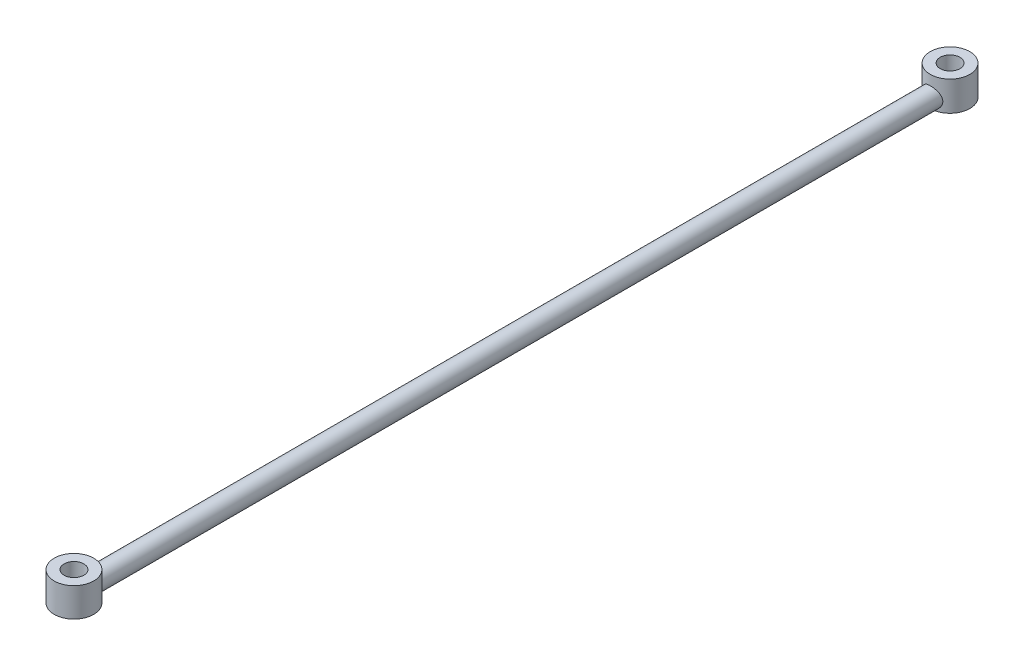
ISO-10303-21;
HEADER;
FILE_DESCRIPTION(('STEP AP214'),'2;1');
FILE_NAME('part.step','',(''),(''),'','','');
FILE_SCHEMA(('AUTOMOTIVE_DESIGN { 1 0 10303 214 1 1 1 1 }'));
ENDSEC;
DATA;
#1=APPLICATION_CONTEXT('core data for automotive mechanical design processes');
#2=APPLICATION_PROTOCOL_DEFINITION('international standard','automotive_design',2000,#1);
#3=PRODUCT_CONTEXT('',#1,'mechanical');
#4=PRODUCT('Part','Part','',(#3));
#5=PRODUCT_RELATED_PRODUCT_CATEGORY('part','',(#4));
#6=PRODUCT_DEFINITION_FORMATION('','',#4);
#7=PRODUCT_DEFINITION_CONTEXT('part definition',#1,'design');
#8=PRODUCT_DEFINITION('design','',#6,#7);
#9=PRODUCT_DEFINITION_SHAPE('','',#8);
#10=(LENGTH_UNIT() NAMED_UNIT(*) SI_UNIT(.MILLI.,.METRE.));
#11=(NAMED_UNIT(*) PLANE_ANGLE_UNIT() SI_UNIT($,.RADIAN.));
#12=(NAMED_UNIT(*) SI_UNIT($,.STERADIAN.) SOLID_ANGLE_UNIT());
#13=UNCERTAINTY_MEASURE_WITH_UNIT(LENGTH_MEASURE(1.E-05),#10,'distance_accuracy_value','');
#14=(GEOMETRIC_REPRESENTATION_CONTEXT(3) GLOBAL_UNCERTAINTY_ASSIGNED_CONTEXT((#13)) GLOBAL_UNIT_ASSIGNED_CONTEXT((#10,
#11,#12)) REPRESENTATION_CONTEXT('',''));
#15=CARTESIAN_POINT('',(0.,0.,0.));
#16=DIRECTION('',(0.,0.,1.));
#17=DIRECTION('',(1.,0.,0.));
#18=AXIS2_PLACEMENT_3D('',#15,#16,#17);
#19=CARTESIAN_POINT('',(0.,1.5,131.4));
#20=DIRECTION('',(0.,0.,-1.));
#21=DIRECTION('',(-1.,0.,0.));
#22=AXIS2_PLACEMENT_3D('',#19,#20,#21);
#23=CYLINDRICAL_SURFACE('',#22,1.5);
#24=CARTESIAN_POINT('',(0.,3.,3.));
#25=CARTESIAN_POINT('',(-0.0788579444268502,2.99999504652421,2.99999570107562));
#26=CARTESIAN_POINT('',(-0.157809899546344,2.99374489031842,2.99685736529635));
#27=CARTESIAN_POINT('',(-0.313380352903344,2.96902067948769,2.98461234055736));
#28=CARTESIAN_POINT('',(-0.389994130070444,2.95052341050328,2.97549431743379));
#29=CARTESIAN_POINT('',(-0.538400317320674,2.90220928707506,2.95224419105063));
#30=CARTESIAN_POINT('',(-0.61021020440872,2.87243642362805,2.93813158766306));
#31=CARTESIAN_POINT('',(-0.747708925209898,2.80264406795252,2.90618664773642));
#32=CARTESIAN_POINT('',(-0.813398240985089,2.7626253836267,2.88835460450288));
#33=CARTESIAN_POINT('',(-0.941261726642864,2.67072412577207,2.84934387387093));
#34=CARTESIAN_POINT('',(-1.00298281668316,2.61827028114054,2.82802798691306));
#35=CARTESIAN_POINT('',(-1.11716916730047,2.50421778112944,2.78489955370115));
#36=CARTESIAN_POINT('',(-1.16962737466015,2.44261222234134,2.76308664313552));
#37=CARTESIAN_POINT('',(-1.26787800067542,2.30627497571493,2.71948426796021));
#38=CARTESIAN_POINT('',(-1.31283800332746,2.23089585248113,2.69782780455198));
#39=CARTESIAN_POINT('',(-1.38925234033604,2.07244899602068,2.65928968158481));
#40=CARTESIAN_POINT('',(-1.4207163224495,1.98938680691588,2.64240461410484));
#41=CARTESIAN_POINT('',(-1.46719866328288,1.82300234186712,2.61686800556713));
#42=CARTESIAN_POINT('',(-1.48308878562066,1.73999332189891,2.6077840737557));
#43=CARTESIAN_POINT('',(-1.50064048996327,1.57203174333078,2.59772834922792));
#44=CARTESIAN_POINT('',(-1.50231613255961,1.48708118869327,2.59674854014932));
#45=CARTESIAN_POINT('',(-1.49203093075844,1.32857096352695,2.60266395385873));
#46=CARTESIAN_POINT('',(-1.48167683930523,1.25486395316542,2.6086314549302));
#47=CARTESIAN_POINT('',(-1.4504097735854,1.11041713594044,2.62614343100775));
#48=CARTESIAN_POINT('',(-1.42949343584648,1.03967828204203,2.63768968247664));
#49=CARTESIAN_POINT('',(-1.37731467057901,0.901156301151511,2.66531214619112));
#50=CARTESIAN_POINT('',(-1.34582260067399,0.833480401821317,2.68148760995998));
#51=CARTESIAN_POINT('',(-1.273562531502,0.704048561114988,2.71655106422106));
#52=CARTESIAN_POINT('',(-1.2327903657187,0.642295296599867,2.73544027170286));
#53=CARTESIAN_POINT('',(-1.13709908236918,0.518218120885161,2.77669736854929));
#54=CARTESIAN_POINT('',(-1.08104168755392,0.456814689635764,2.79920265355119));
#55=CARTESIAN_POINT('',(-0.95933336811206,0.343896872113648,2.84321434950611));
#56=CARTESIAN_POINT('',(-0.893677884861428,0.292387211949176,2.86472027938201));
#57=CARTESIAN_POINT('',(-0.750774758747773,0.198471508455409,2.90552980924446));
#58=CARTESIAN_POINT('',(-0.673130387399113,0.156599291331389,2.92468476243011));
#59=CARTESIAN_POINT('',(-0.510699323233195,0.0868544564354861,2.95736821681863));
#60=CARTESIAN_POINT('',(-0.425918364397914,0.0589707224772501,2.9709011841533));
#61=CARTESIAN_POINT('',(-0.259149737491053,0.0202868944249849,2.98986500612153));
#62=CARTESIAN_POINT('',(-0.177512295822489,0.00826314637982768,2.99587407451965));
#63=CARTESIAN_POINT('',(-0.0131693999240277,-0.00219709670173116,3.00109520188655));
#64=CARTESIAN_POINT('',(0.0695355298048628,-0.000640028459202768,3.00031048081978));
#65=CARTESIAN_POINT('',(0.22684945797898,0.0153100326281151,2.99236788380152));
#66=CARTESIAN_POINT('',(0.301589112074895,0.0286987990949908,2.98570868532253));
#67=CARTESIAN_POINT('',(0.447610338452911,0.0663571078426821,2.9673325697226));
#68=CARTESIAN_POINT('',(0.51889152853663,0.0906278496802406,2.95561509501618));
#69=CARTESIAN_POINT('',(0.658332912674359,0.149997699649549,2.92776377120382));
#70=CARTESIAN_POINT('',(0.726345595508705,0.18538657517443,2.91151322654446));
#71=CARTESIAN_POINT('',(0.855692042548907,0.265661303469851,2.87615961476126));
#72=CARTESIAN_POINT('',(0.917022944664887,0.310551201893093,2.85705533350407));
#73=CARTESIAN_POINT('',(1.03765153393382,0.413640637996074,2.81562332004297));
#74=CARTESIAN_POINT('',(1.09615811672854,0.47271430266772,2.79316327265249));
#75=CARTESIAN_POINT('',(1.20278448167828,0.599887726916591,2.7489358741323));
#76=CARTESIAN_POINT('',(1.25089707856781,0.667993678271879,2.72716901100071));
#77=CARTESIAN_POINT('',(1.33756187171853,0.815465481259463,2.68576788309734));
#78=CARTESIAN_POINT('',(1.37553824370037,0.895216899141722,2.66628794383591));
#79=CARTESIAN_POINT('',(1.43712423890206,1.06126510136245,2.63361108441202));
#80=CARTESIAN_POINT('',(1.46075237380052,1.14755328970033,2.62040607332625));
#81=CARTESIAN_POINT('',(1.49079253120031,1.31536533432706,2.60342251538703));
#82=CARTESIAN_POINT('',(1.49863949460818,1.39655138015286,2.59886075197597));
#83=CARTESIAN_POINT('',(1.5010337315643,1.55917060074679,2.59748031962405));
#84=CARTESIAN_POINT('',(1.49558676993486,1.64060365310679,2.60065829439585));
#85=CARTESIAN_POINT('',(1.47288918838996,1.79322525230016,2.61356793076615));
#86=CARTESIAN_POINT('',(1.45681247151455,1.86465070521711,2.62264641723988));
#87=CARTESIAN_POINT('',(1.41476303733662,2.00371217913655,2.64556524281479));
#88=CARTESIAN_POINT('',(1.38878713673988,2.07134697313805,2.65940711354503));
#89=CARTESIAN_POINT('',(1.32572361795085,2.2059372764798,2.69142795546804));
#90=CARTESIAN_POINT('',(1.28800670672355,2.27254185274354,2.70983583593881));
#91=CARTESIAN_POINT('',(1.20322645745609,2.39891180427189,2.74852997452291));
#92=CARTESIAN_POINT('',(1.15615825686234,2.45867359578167,2.76881720693416));
#93=CARTESIAN_POINT('',(1.04730498999206,2.57721297353201,2.81193484737138));
#94=CARTESIAN_POINT('',(0.984426634495892,2.63498865352544,2.83477474959942));
#95=CARTESIAN_POINT('',(0.849232209349796,2.7393944751529,2.87816628389896));
#96=CARTESIAN_POINT('',(0.776911084957796,2.78601860920486,2.89871667939293));
#97=CARTESIAN_POINT('',(0.623897395174419,2.86685454406811,2.93547014349806));
#98=CARTESIAN_POINT('',(0.543149255665096,2.9009762538547,2.95164144740899));
#99=CARTESIAN_POINT('',(0.37611315170713,2.95471225163611,2.9775201194848));
#100=CARTESIAN_POINT('',(0.28984169938365,2.97436777020857,2.98724585044602));
#101=CARTESIAN_POINT('',(0.168902919736343,2.99084611662861,2.99543192870217));
#102=CARTESIAN_POINT('',(0.135242819162348,2.99427396129951,2.99714048010376));
#103=CARTESIAN_POINT('',(0.067727597707638,2.99885199827113,2.99942545465223));
#104=CARTESIAN_POINT('',(0.033872471469943,3.00000212770531,3.00000184655071));
#105=CARTESIAN_POINT('',(0.,3.,3.));
#106=B_SPLINE_CURVE_WITH_KNOTS('',3,(#24,#25,#26,#27,#28,#29,#30,#31,#32,#33,#34,#35,#36,#37,
#38,#39,#40,#41,#42,#43,#44,#45,#46,#47,#48,#49,#50,#51,#52,#53,#54,#55,#56,#57,#58,#59,#60,#61,
#62,#63,#64,#65,#66,#67,#68,#69,#70,#71,#72,#73,#74,#75,#76,#77,#78,#79,#80,#81,#82,#83,#84,#85,
#86,#87,#88,#89,#90,#91,#92,#93,#94,#95,#96,#97,#98,#99,#100,#101,#102,#103,#104,#105),
.UNSPECIFIED.,.T.,.F.,(4,2,2,2,2,2,2,2,2,2,2,2,2,2,2,2,2,2,2,2,2,2,2,2,2,2,2,2,2,2,2,2,2,2,2,2,
2,2,2,2,4),(0.,0.236436386130439,0.473322224563797,0.709293233238448,0.945245640872352,
1.19547263807713,1.44588935648105,1.71572589646129,1.98536921847421,2.23887018210344,
2.49212035993531,2.71508568613981,2.93812205888518,3.16635360252731,3.39468781890333,
3.65197412000818,3.90938301898029,4.17874533321661,4.44789325368419,4.69474935707018,
4.94148846767214,5.16910359759183,5.39674382446397,5.63089284041848,5.86514176122509,
6.12239415966628,6.37982382923148,6.64972023242589,6.91926767918176,7.1629396125457,
7.40650589797018,7.62686895373284,7.84730293182527,8.08254685170431,8.31791341715446,
8.58187864135757,8.84598575071869,9.1119602049529,9.37717362931724,9.47872920200875,
9.58028757766599),.UNSPECIFIED.);
#107=CARTESIAN_POINT('',(0.,0.,3.));
#108=VERTEX_POINT('',#107);
#109=EDGE_CURVE('E53',#108,#108,#106,.T.);
#110=ORIENTED_EDGE('',*,*,#109,.T.);
#111=EDGE_LOOP('',(#110));
#112=FACE_BOUND('',#111,.T.);
#113=CARTESIAN_POINT('',(0.,0.,130.));
#114=CARTESIAN_POINT('',(0.0789218825988931,3.99837243889451E-06,130.000003519042));
#115=CARTESIAN_POINT('',(0.157888018690982,0.00626048322756016,130.003145272599));
#116=CARTESIAN_POINT('',(0.313440887815248,0.0309960098236148,130.015395950603));
#117=CARTESIAN_POINT('',(0.390025133413917,0.0494874076762033,130.024510907334));
#118=CARTESIAN_POINT('',(0.538394991352701,0.0977882566500251,130.047754608233));
#119=CARTESIAN_POINT('',(0.610196537431105,0.127557662063664,130.061865601113));
#120=CARTESIAN_POINT('',(0.747695382591084,0.197348033995561,130.093809841213));
#121=CARTESIAN_POINT('',(0.813391957637065,0.237370214360308,130.111643529124));
#122=CARTESIAN_POINT('',(0.941263148420377,0.329276775116849,130.150656506193));
#123=CARTESIAN_POINT('',(1.00298521392389,0.381731718451949,130.171972825347));
#124=CARTESIAN_POINT('',(1.11717112049013,0.495784565123354,130.215101277311));
#125=CARTESIAN_POINT('',(1.16962826192667,0.55738902585497,130.236913756141));
#126=CARTESIAN_POINT('',(1.26787791142158,0.693724882131813,130.280515686484));
#127=CARTESIAN_POINT('',(1.31283782817297,0.769103847617383,130.302172109417));
#128=CARTESIAN_POINT('',(1.38925221222965,0.927550675203882,130.340710251515));
#129=CARTESIAN_POINT('',(1.42071627405102,1.01061302376911,130.357595359795));
#130=CARTESIAN_POINT('',(1.46719863539269,1.17699755460627,130.383131978651));
#131=CARTESIAN_POINT('',(1.48308874539862,1.26000646422331,130.39221590313));
#132=CARTESIAN_POINT('',(1.50064048490788,1.42796803773669,130.402271647928));
#133=CARTESIAN_POINT('',(1.50231613856544,1.5129187028583,130.403251463834));
#134=CARTESIAN_POINT('',(1.49203092801098,1.67142909280504,130.397336044095));
#135=CARTESIAN_POINT('',(1.48167682642417,1.74513615845646,130.39136853597));
#136=CARTESIAN_POINT('',(1.45040973905553,1.88958297144548,130.37385655163));
#137=CARTESIAN_POINT('',(1.42949340574906,1.96032177033689,130.362310307377));
#138=CARTESIAN_POINT('',(1.37731440002948,2.09884444525576,130.334687704664));
#139=CARTESIAN_POINT('',(1.34582196992071,2.16652103933381,130.318512044456));
#140=CARTESIAN_POINT('',(1.27356161685574,2.29595276552004,130.283448531494));
#141=CARTESIAN_POINT('',(1.23278972487428,2.3577053476881,130.264559519459));
#142=CARTESIAN_POINT('',(1.13710399971422,2.48177571339388,130.223304675545));
#143=CARTESIAN_POINT('',(1.08105287511733,2.54317374445979,130.200801558693));
#144=CARTESIAN_POINT('',(0.959344985170853,2.65609353675068,130.156789684142));
#145=CARTESIAN_POINT('',(0.893681872302493,2.70760871924097,130.135281595984));
#146=CARTESIAN_POINT('',(0.7507365762813,2.80155510122917,130.094458515586));
#147=CARTESIAN_POINT('',(0.673053758418783,2.84344660808342,130.075293791987));
#148=CARTESIAN_POINT('',(0.51059363925435,2.91317794944937,130.042616528684));
#149=CARTESIAN_POINT('',(0.425830188645921,2.94104450147165,130.029093250515));
#150=CARTESIAN_POINT('',(0.283628488529054,2.97403831650542,130.01291571575));
#151=CARTESIAN_POINT('',(0.227460494637181,2.98374945615665,130.00809734093));
#152=CARTESIAN_POINT('',(0.114202664250238,2.99673142554489,130.001638367202));
#153=CARTESIAN_POINT('',(0.0571129196695962,3.00000289347791,129.999997453396));
#154=CARTESIAN_POINT('',(-0.0789218825988934,2.99999600162756,130.000003519042));
#155=CARTESIAN_POINT('',(-0.157888018690983,2.99373951677244,130.003145272599));
#156=CARTESIAN_POINT('',(-0.313440887815249,2.96900399017638,130.015395950603));
#157=CARTESIAN_POINT('',(-0.390025133413918,2.9505125923238,130.024510907334));
#158=CARTESIAN_POINT('',(-0.538394991352701,2.90221174334997,130.047754608233));
#159=CARTESIAN_POINT('',(-0.610196537431105,2.87244233793634,130.061865601113));
#160=CARTESIAN_POINT('',(-0.747695382591084,2.80265196600444,130.093809841213));
#161=CARTESIAN_POINT('',(-0.813391957637065,2.76262978563969,130.111643529124));
#162=CARTESIAN_POINT('',(-0.941263148420377,2.67072322488315,130.150656506193));
#163=CARTESIAN_POINT('',(-1.00298521392389,2.61826828154805,130.171972825347));
#164=CARTESIAN_POINT('',(-1.11717112049013,2.50421543487665,130.215101277311));
#165=CARTESIAN_POINT('',(-1.16962826192667,2.44261097414503,130.236913756141));
#166=CARTESIAN_POINT('',(-1.26787791142158,2.30627511786819,130.280515686484));
#167=CARTESIAN_POINT('',(-1.31283782817297,2.23089615238262,130.302172109417));
#168=CARTESIAN_POINT('',(-1.38925221222965,2.07244932479612,130.340710251515));
#169=CARTESIAN_POINT('',(-1.42071627405102,1.98938697623089,130.357595359795));
#170=CARTESIAN_POINT('',(-1.46719863539269,1.82300244539373,130.383131978651));
#171=CARTESIAN_POINT('',(-1.48308874539862,1.73999353577669,130.39221590313));
#172=CARTESIAN_POINT('',(-1.50064048490788,1.57203196226331,130.402271647928));
#173=CARTESIAN_POINT('',(-1.50231613856544,1.4870812971417,130.403251463834));
#174=CARTESIAN_POINT('',(-1.49203092801098,1.32857090719496,130.397336044095));
#175=CARTESIAN_POINT('',(-1.48167682642417,1.25486384154354,130.39136853597));
#176=CARTESIAN_POINT('',(-1.45040973905553,1.11041702855452,130.37385655163));
#177=CARTESIAN_POINT('',(-1.42949340574906,1.03967822966311,130.362310307377));
#178=CARTESIAN_POINT('',(-1.37731440002948,0.90115555474424,130.334687704664));
#179=CARTESIAN_POINT('',(-1.34582196992071,0.833478960666193,130.318512044456));
#180=CARTESIAN_POINT('',(-1.27356161685574,0.704047234479958,130.283448531494));
#181=CARTESIAN_POINT('',(-1.23278972487428,0.642294652311904,130.264559519459));
#182=CARTESIAN_POINT('',(-1.13710399971422,0.518224286606123,130.223304675545));
#183=CARTESIAN_POINT('',(-1.08105287511733,0.456826255540209,130.200801558693));
#184=CARTESIAN_POINT('',(-0.959344985170849,0.343906463249316,130.156789684142));
#185=CARTESIAN_POINT('',(-0.893681872302488,0.292391280759028,130.135281595984));
#186=CARTESIAN_POINT('',(-0.750736576281295,0.198444898770824,130.094458515586));
#187=CARTESIAN_POINT('',(-0.673053758418778,0.156553391916577,130.075293791987));
#188=CARTESIAN_POINT('',(-0.510593639254348,0.0868220505506322,130.042616528684));
#189=CARTESIAN_POINT('',(-0.425830188645919,0.0589554985283487,130.029093250515));
#190=CARTESIAN_POINT('',(-0.283628488529054,0.0259616834945789,130.01291571575));
#191=CARTESIAN_POINT('',(-0.227460494637182,0.0162505438433496,130.00809734093));
#192=CARTESIAN_POINT('',(-0.114202664250238,0.00326857445510901,130.001638367202));
#193=CARTESIAN_POINT('',(-0.0571129196695961,-2.89347790995184E-06,129.999997453396));
#194=CARTESIAN_POINT('',(0.,0.,130.));
#195=B_SPLINE_CURVE_WITH_KNOTS('',3,(#113,#114,#115,#116,#117,#118,#119,#120,#121,#122,#123,
#124,#125,#126,#127,#128,#129,#130,#131,#132,#133,#134,#135,#136,#137,#138,#139,#140,#141,#142,
#143,#144,#145,#146,#147,#148,#149,#150,#151,#152,#153,#154,#155,#156,#157,#158,#159,#160,#161,
#162,#163,#164,#165,#166,#167,#168,#169,#170,#171,#172,#173,#174,#175,#176,#177,#178,#179,#180,
#181,#182,#183,#184,#185,#186,#187,#188,#189,#190,#191,#192,#193,#194),.UNSPECIFIED.,.T.,.F.,(4,
2,2,2,2,2,2,2,2,2,2,2,2,2,2,2,2,2,2,2,2,2,2,2,2,2,2,2,2,2,2,2,2,2,2,2,2,2,2,2,4),(0.,
0.236541480428308,0.47332221087399,0.70926994793719,0.945245632244092,1.19547738368133,
1.44588934770069,1.71572535454869,1.98536920948835,2.23886984814452,2.49212035088587,
2.71508584553352,2.93812204979932,3.16635602724595,3.39468780934255,3.65195007713057,
3.90938300743745,4.17889584105613,4.44789329129262,4.61908679524576,4.79026333241593,
5.02680481284424,5.26358554328992,5.49953328035312,5.73550896466002,5.98574071609727,
6.23615268011663,6.50598868696463,6.77563254190428,7.02913318056045,7.2823836833018,
7.50534917794945,7.72838538221526,7.95661935966188,8.18495114175848,8.4422134095465,
8.69964633985339,8.96915917347207,9.23815662370855,9.4093501276617,9.58052666483187),.UNSPECIFIED.);
#196=CARTESIAN_POINT('',(0.,0.,130.));
#197=VERTEX_POINT('',#196);
#198=EDGE_CURVE('E11',#197,#197,#195,.T.);
#199=ORIENTED_EDGE('',*,*,#198,.F.);
#200=EDGE_LOOP('',(#199));
#201=FACE_BOUND('',#200,.T.);
#202=ADVANCED_FACE('F39',(#112,#201),#23,.T.);
#203=CARTESIAN_POINT('',(0.,3.,0.));
#204=DIRECTION('',(0.,-1.,0.));
#205=DIRECTION('',(0.,0.,-1.));
#206=AXIS2_PLACEMENT_3D('',#203,#204,#205);
#207=CYLINDRICAL_SURFACE('',#206,3.);
#208=CARTESIAN_POINT('',(0.,0.,0.));
#209=DIRECTION('',(0.,1.,0.));
#210=DIRECTION('',(0.,0.,1.));
#211=AXIS2_PLACEMENT_3D('',#208,#209,#210);
#212=CIRCLE('',#211,3.);
#213=EDGE_CURVE('E64',#108,#108,#212,.T.);
#214=ORIENTED_EDGE('',*,*,#213,.T.);
#215=ORIENTED_EDGE('',*,*,#109,.F.);
#216=EDGE_LOOP('',(#214,#215));
#217=FACE_BOUND('',#216,.T.);
#218=CARTESIAN_POINT('',(0.,4.5,0.));
#219=DIRECTION('',(0.,1.,0.));
#220=DIRECTION('',(0.,0.,1.));
#221=AXIS2_PLACEMENT_3D('',#218,#219,#220);
#222=CIRCLE('',#221,3.);
#223=CARTESIAN_POINT('',(0.,4.5,3.));
#224=VERTEX_POINT('',#223);
#225=EDGE_CURVE('E99',#224,#224,#222,.T.);
#226=ORIENTED_EDGE('',*,*,#225,.F.);
#227=EDGE_LOOP('',(#226));
#228=FACE_BOUND('',#227,.T.);
#229=ADVANCED_FACE('F41',(#217,#228),#207,.T.);
#230=CARTESIAN_POINT('',(0.,0.,0.));
#231=DIRECTION('',(0.,1.,0.));
#232=DIRECTION('',(0.,0.,1.));
#233=AXIS2_PLACEMENT_3D('',#230,#231,#232);
#234=PLANE('',#233);
#235=ORIENTED_EDGE('',*,*,#213,.F.);
#236=EDGE_LOOP('',(#235));
#237=FACE_BOUND('',#236,.T.);
#238=CARTESIAN_POINT('',(0.,0.,0.));
#239=DIRECTION('',(0.,1.,0.));
#240=DIRECTION('',(0.,0.,1.));
#241=AXIS2_PLACEMENT_3D('',#238,#239,#240);
#242=CIRCLE('',#241,1.5);
#243=CARTESIAN_POINT('',(0.,0.,1.5));
#244=VERTEX_POINT('',#243);
#245=EDGE_CURVE('E65',#244,#244,#242,.T.);
#246=ORIENTED_EDGE('',*,*,#245,.T.);
#247=EDGE_LOOP('',(#246));
#248=FACE_BOUND('',#247,.T.);
#249=ADVANCED_FACE('F80',(#237,#248),#234,.F.);
#250=CARTESIAN_POINT('',(0.,3.,0.));
#251=DIRECTION('',(0.,-1.,0.));
#252=DIRECTION('',(0.,0.,-1.));
#253=AXIS2_PLACEMENT_3D('',#250,#251,#252);
#254=CYLINDRICAL_SURFACE('',#253,1.5);
#255=ORIENTED_EDGE('',*,*,#245,.F.);
#256=EDGE_LOOP('',(#255));
#257=FACE_BOUND('',#256,.T.);
#258=CARTESIAN_POINT('',(0.,4.5,0.));
#259=DIRECTION('',(0.,1.,0.));
#260=DIRECTION('',(0.,0.,1.));
#261=AXIS2_PLACEMENT_3D('',#258,#259,#260);
#262=CIRCLE('',#261,1.5);
#263=CARTESIAN_POINT('',(0.,4.5,1.5));
#264=VERTEX_POINT('',#263);
#265=EDGE_CURVE('E102',#264,#264,#262,.T.);
#266=ORIENTED_EDGE('',*,*,#265,.T.);
#267=EDGE_LOOP('',(#266));
#268=FACE_BOUND('',#267,.T.);
#269=ADVANCED_FACE('F77',(#257,#268),#254,.F.);
#270=CARTESIAN_POINT('',(0.,3.,133.));
#271=DIRECTION('',(0.,-1.,0.));
#272=DIRECTION('',(0.,0.,-1.));
#273=AXIS2_PLACEMENT_3D('',#270,#271,#272);
#274=CYLINDRICAL_SURFACE('',#273,3.);
#275=ORIENTED_EDGE('',*,*,#198,.T.);
#276=CARTESIAN_POINT('',(0.,0.,133.));
#277=DIRECTION('',(0.,1.,0.));
#278=DIRECTION('',(0.,0.,1.));
#279=AXIS2_PLACEMENT_3D('',#276,#277,#278);
#280=CIRCLE('',#279,3.);
#281=EDGE_CURVE('E93',#197,#197,#280,.T.);
#282=ORIENTED_EDGE('',*,*,#281,.T.);
#283=EDGE_LOOP('',(#275,#282));
#284=FACE_BOUND('',#283,.T.);
#285=CARTESIAN_POINT('',(0.,4.4,133.));
#286=DIRECTION('',(0.,1.,0.));
#287=DIRECTION('',(0.,0.,1.));
#288=AXIS2_PLACEMENT_3D('',#285,#286,#287);
#289=CIRCLE('',#288,3.);
#290=CARTESIAN_POINT('',(0.,4.4,136.));
#291=VERTEX_POINT('',#290);
#292=EDGE_CURVE('E105',#291,#291,#289,.T.);
#293=ORIENTED_EDGE('',*,*,#292,.F.);
#294=EDGE_LOOP('',(#293));
#295=FACE_BOUND('',#294,.T.);
#296=ADVANCED_FACE('F74',(#284,#295),#274,.T.);
#297=CARTESIAN_POINT('',(0.,0.,133.));
#298=DIRECTION('',(0.,1.,0.));
#299=DIRECTION('',(0.,0.,1.));
#300=AXIS2_PLACEMENT_3D('',#297,#298,#299);
#301=PLANE('',#300);
#302=ORIENTED_EDGE('',*,*,#281,.F.);
#303=EDGE_LOOP('',(#302));
#304=FACE_BOUND('',#303,.T.);
#305=CARTESIAN_POINT('',(0.,0.,133.));
#306=DIRECTION('',(0.,1.,0.));
#307=DIRECTION('',(0.,0.,1.));
#308=AXIS2_PLACEMENT_3D('',#305,#306,#307);
#309=CIRCLE('',#308,1.5);
#310=CARTESIAN_POINT('',(0.,0.,134.5));
#311=VERTEX_POINT('',#310);
#312=EDGE_CURVE('E94',#311,#311,#309,.T.);
#313=ORIENTED_EDGE('',*,*,#312,.T.);
#314=EDGE_LOOP('',(#313));
#315=FACE_BOUND('',#314,.T.);
#316=ADVANCED_FACE('F126',(#304,#315),#301,.F.);
#317=CARTESIAN_POINT('',(0.,3.,133.));
#318=DIRECTION('',(0.,-1.,0.));
#319=DIRECTION('',(0.,0.,-1.));
#320=AXIS2_PLACEMENT_3D('',#317,#318,#319);
#321=CYLINDRICAL_SURFACE('',#320,1.5);
#322=ORIENTED_EDGE('',*,*,#312,.F.);
#323=EDGE_LOOP('',(#322));
#324=FACE_BOUND('',#323,.T.);
#325=CARTESIAN_POINT('',(0.,4.4,133.));
#326=DIRECTION('',(0.,1.,0.));
#327=DIRECTION('',(0.,0.,1.));
#328=AXIS2_PLACEMENT_3D('',#325,#326,#327);
#329=CIRCLE('',#328,1.50000000000001);
#330=CARTESIAN_POINT('',(0.,4.4,134.5));
#331=VERTEX_POINT('',#330);
#332=EDGE_CURVE('E108',#331,#331,#329,.T.);
#333=ORIENTED_EDGE('',*,*,#332,.T.);
#334=EDGE_LOOP('',(#333));
#335=FACE_BOUND('',#334,.T.);
#336=ADVANCED_FACE('F112',(#324,#335),#321,.F.);
#337=CARTESIAN_POINT('',(0.,4.5,0.));
#338=DIRECTION('',(0.,1.,0.));
#339=DIRECTION('',(0.,0.,1.));
#340=AXIS2_PLACEMENT_3D('',#337,#338,#339);
#341=PLANE('',#340);
#342=ORIENTED_EDGE('',*,*,#225,.T.);
#343=EDGE_LOOP('',(#342));
#344=FACE_BOUND('',#343,.T.);
#345=ORIENTED_EDGE('',*,*,#265,.F.);
#346=EDGE_LOOP('',(#345));
#347=FACE_BOUND('',#346,.T.);
#348=ADVANCED_FACE('F116',(#344,#347),#341,.T.);
#349=CARTESIAN_POINT('',(0.,4.4,133.));
#350=DIRECTION('',(0.,1.,0.));
#351=DIRECTION('',(0.,0.,1.));
#352=AXIS2_PLACEMENT_3D('',#349,#350,#351);
#353=PLANE('',#352);
#354=ORIENTED_EDGE('',*,*,#292,.T.);
#355=EDGE_LOOP('',(#354));
#356=FACE_BOUND('',#355,.T.);
#357=ORIENTED_EDGE('',*,*,#332,.F.);
#358=EDGE_LOOP('',(#357));
#359=FACE_BOUND('',#358,.T.);
#360=ADVANCED_FACE('F114',(#356,#359),#353,.T.);
#361=CLOSED_SHELL('',(#202,#229,#249,#269,#296,#316,#336,#348,#360));
#362=MANIFOLD_SOLID_BREP('B2',#361);
#363=ADVANCED_BREP_SHAPE_REPRESENTATION('',(#18,#362),#14);
#364=SHAPE_DEFINITION_REPRESENTATION(#9,#363);
ENDSEC;
END-ISO-10303-21;
